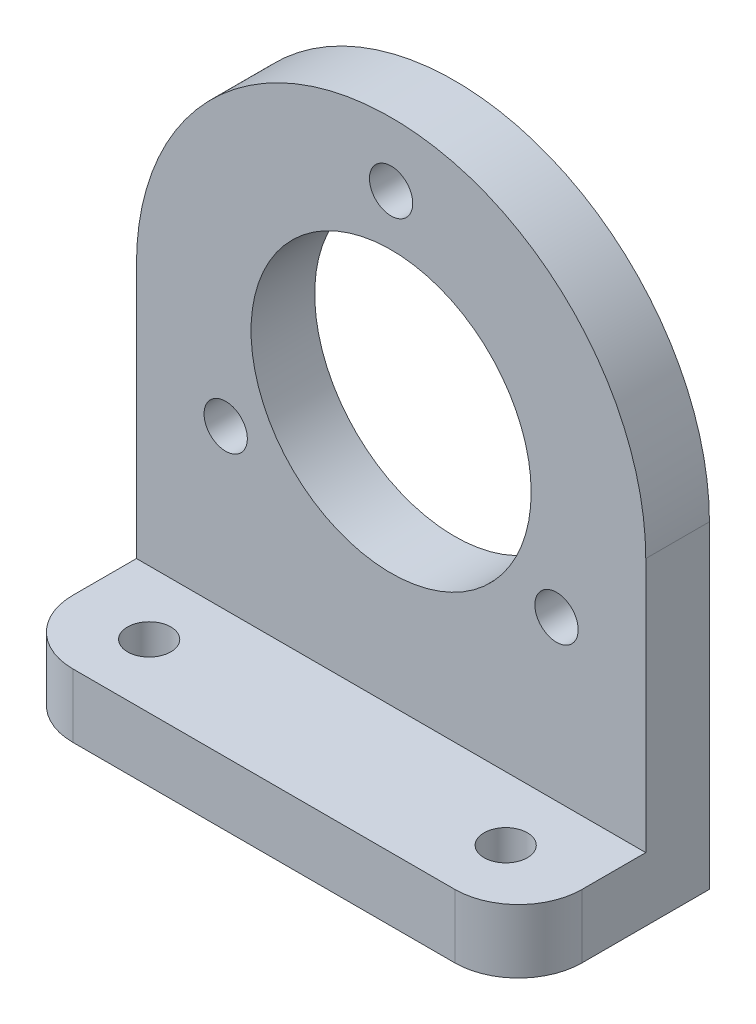
ISO-10303-21;
HEADER;
FILE_DESCRIPTION(('STEP AP214'),'2;1');
FILE_NAME('part.step','',(''),(''),'','','');
FILE_SCHEMA(('AUTOMOTIVE_DESIGN { 1 0 10303 214 1 1 1 1 }'));
ENDSEC;
DATA;
#1=APPLICATION_CONTEXT('core data for automotive mechanical design processes');
#2=APPLICATION_PROTOCOL_DEFINITION('international standard','automotive_design',2000,#1);
#3=PRODUCT_CONTEXT('',#1,'mechanical');
#4=PRODUCT('Part','Part','',(#3));
#5=PRODUCT_RELATED_PRODUCT_CATEGORY('part','',(#4));
#6=PRODUCT_DEFINITION_FORMATION('','',#4);
#7=PRODUCT_DEFINITION_CONTEXT('part definition',#1,'design');
#8=PRODUCT_DEFINITION('design','',#6,#7);
#9=PRODUCT_DEFINITION_SHAPE('','',#8);
#10=(LENGTH_UNIT() NAMED_UNIT(*) SI_UNIT(.MILLI.,.METRE.));
#11=(NAMED_UNIT(*) PLANE_ANGLE_UNIT() SI_UNIT($,.RADIAN.));
#12=(NAMED_UNIT(*) SI_UNIT($,.STERADIAN.) SOLID_ANGLE_UNIT());
#13=UNCERTAINTY_MEASURE_WITH_UNIT(LENGTH_MEASURE(1.E-05),#10,'distance_accuracy_value','');
#14=(GEOMETRIC_REPRESENTATION_CONTEXT(3) GLOBAL_UNCERTAINTY_ASSIGNED_CONTEXT((#13)) GLOBAL_UNIT_ASSIGNED_CONTEXT((#10,
#11,#12)) REPRESENTATION_CONTEXT('',''));
#15=CARTESIAN_POINT('',(0.,0.,0.));
#16=DIRECTION('',(0.,0.,1.));
#17=DIRECTION('',(1.,0.,0.));
#18=AXIS2_PLACEMENT_3D('',#15,#16,#17);
#19=CARTESIAN_POINT('',(-20.,-25.,15.));
#20=DIRECTION('',(0.,1.,0.));
#21=DIRECTION('',(0.,0.,1.));
#22=AXIS2_PLACEMENT_3D('',#19,#20,#21);
#23=PLANE('',#22);
#24=CARTESIAN_POINT('',(-14.,-25.,10.));
#25=DIRECTION('',(0.,1.,0.));
#26=DIRECTION('',(0.,0.,1.));
#27=AXIS2_PLACEMENT_3D('',#24,#25,#26);
#28=CIRCLE('',#27,1.69999999999999);
#29=CARTESIAN_POINT('',(-14.,-25.,11.7));
#30=VERTEX_POINT('',#29);
#31=EDGE_CURVE('E387',#30,#30,#28,.F.);
#32=ORIENTED_EDGE('',*,*,#31,.F.);
#33=EDGE_LOOP('',(#32));
#34=FACE_BOUND('',#33,.T.);
#35=DIRECTION('',(0.,0.,-1.));
#36=VECTOR('',#35,1.);
#37=CARTESIAN_POINT('',(20.,-25.,15.));
#38=LINE('',#37,#36);
#39=CARTESIAN_POINT('',(20.,-25.,10.));
#40=VERTEX_POINT('',#39);
#41=CARTESIAN_POINT('',(20.,-25.,0.));
#42=VERTEX_POINT('',#41);
#43=EDGE_CURVE('E110',#40,#42,#38,.T.);
#44=ORIENTED_EDGE('',*,*,#43,.F.);
#45=CARTESIAN_POINT('',(15.,-25.,10.));
#46=DIRECTION('',(0.,1.,0.));
#47=DIRECTION('',(0.,0.,1.));
#48=AXIS2_PLACEMENT_3D('',#45,#46,#47);
#49=CIRCLE('',#48,5.);
#50=CARTESIAN_POINT('',(15.,-25.,15.));
#51=VERTEX_POINT('',#50);
#52=EDGE_CURVE('E47',#40,#51,#49,.F.);
#53=ORIENTED_EDGE('',*,*,#52,.T.);
#54=DIRECTION('',(1.,0.,0.));
#55=VECTOR('',#54,1.);
#56=CARTESIAN_POINT('',(-20.,-25.,15.));
#57=LINE('',#56,#55);
#58=CARTESIAN_POINT('',(-15.,-25.,15.));
#59=VERTEX_POINT('',#58);
#60=EDGE_CURVE('E127',#59,#51,#57,.T.);
#61=ORIENTED_EDGE('',*,*,#60,.F.);
#62=CARTESIAN_POINT('',(-15.,-25.,10.));
#63=DIRECTION('',(0.,1.,0.));
#64=DIRECTION('',(0.,0.,1.));
#65=AXIS2_PLACEMENT_3D('',#62,#63,#64);
#66=CIRCLE('',#65,5.);
#67=CARTESIAN_POINT('',(-20.,-25.,10.));
#68=VERTEX_POINT('',#67);
#69=EDGE_CURVE('E54',#59,#68,#66,.F.);
#70=ORIENTED_EDGE('',*,*,#69,.T.);
#71=DIRECTION('',(0.,0.,-1.));
#72=VECTOR('',#71,1.);
#73=CARTESIAN_POINT('',(-20.,-25.,15.));
#74=LINE('',#73,#72);
#75=CARTESIAN_POINT('',(-20.,-25.,0.));
#76=VERTEX_POINT('',#75);
#77=EDGE_CURVE('E102',#68,#76,#74,.T.);
#78=ORIENTED_EDGE('',*,*,#77,.T.);
#79=DIRECTION('',(1.,0.,0.));
#80=VECTOR('',#79,1.);
#81=CARTESIAN_POINT('',(-20.,-25.,0.));
#82=LINE('',#81,#80);
#83=EDGE_CURVE('E106',#76,#42,#82,.T.);
#84=ORIENTED_EDGE('',*,*,#83,.T.);
#85=EDGE_LOOP('',(#44,#53,#61,#70,#78,#84));
#86=FACE_BOUND('',#85,.T.);
#87=CARTESIAN_POINT('',(14.,-25.,10.));
#88=DIRECTION('',(0.,1.,0.));
#89=DIRECTION('',(0.,0.,1.));
#90=AXIS2_PLACEMENT_3D('',#87,#88,#89);
#91=CIRCLE('',#90,1.69999999999999);
#92=CARTESIAN_POINT('',(14.,-25.,11.7));
#93=VERTEX_POINT('',#92);
#94=EDGE_CURVE('E128',#93,#93,#91,.F.);
#95=ORIENTED_EDGE('',*,*,#94,.F.);
#96=EDGE_LOOP('',(#95));
#97=FACE_BOUND('',#96,.T.);
#98=ADVANCED_FACE('F39',(#34,#86,#97),#23,.F.);
#99=CARTESIAN_POINT('',(0.,0.,0.));
#100=DIRECTION('',(0.,0.,1.));
#101=DIRECTION('',(1.,0.,0.));
#102=AXIS2_PLACEMENT_3D('',#99,#100,#101);
#103=PLANE('',#102);
#104=CARTESIAN_POINT('',(12.9903810567665,-7.50000000000006,0.));
#105=DIRECTION('',(0.,0.,1.));
#106=DIRECTION('',(1.,0.,0.));
#107=AXIS2_PLACEMENT_3D('',#104,#105,#106);
#108=CIRCLE('',#107,1.7);
#109=CARTESIAN_POINT('',(14.6903810567665,-7.50000000000006,0.));
#110=VERTEX_POINT('',#109);
#111=EDGE_CURVE('E149',#110,#110,#108,.F.);
#112=ORIENTED_EDGE('',*,*,#111,.F.);
#113=EDGE_LOOP('',(#112));
#114=FACE_BOUND('',#113,.T.);
#115=CARTESIAN_POINT('',(0.,15.,0.));
#116=DIRECTION('',(0.,0.,1.));
#117=DIRECTION('',(1.,0.,0.));
#118=AXIS2_PLACEMENT_3D('',#115,#116,#117);
#119=CIRCLE('',#118,1.7);
#120=CARTESIAN_POINT('',(1.7,15.,0.));
#121=VERTEX_POINT('',#120);
#122=EDGE_CURVE('E155',#121,#121,#119,.F.);
#123=ORIENTED_EDGE('',*,*,#122,.F.);
#124=EDGE_LOOP('',(#123));
#125=FACE_BOUND('',#124,.T.);
#126=CARTESIAN_POINT('',(0.,0.,0.));
#127=DIRECTION('',(0.,0.,1.));
#128=DIRECTION('',(1.,0.,0.));
#129=AXIS2_PLACEMENT_3D('',#126,#127,#128);
#130=CIRCLE('',#129,11.);
#131=CARTESIAN_POINT('',(11.,0.,0.));
#132=VERTEX_POINT('',#131);
#133=EDGE_CURVE('E158',#132,#132,#130,.T.);
#134=ORIENTED_EDGE('',*,*,#133,.T.);
#135=EDGE_LOOP('',(#134));
#136=FACE_BOUND('',#135,.T.);
#137=CARTESIAN_POINT('',(0.,0.,0.));
#138=DIRECTION('',(0.,0.,1.));
#139=DIRECTION('',(1.,0.,0.));
#140=AXIS2_PLACEMENT_3D('',#137,#138,#139);
#141=CIRCLE('',#140,20.);
#142=CARTESIAN_POINT('',(20.,0.,0.));
#143=VERTEX_POINT('',#142);
#144=CARTESIAN_POINT('',(-20.,0.,0.));
#145=VERTEX_POINT('',#144);
#146=EDGE_CURVE('E121',#143,#145,#141,.T.);
#147=ORIENTED_EDGE('',*,*,#146,.F.);
#148=DIRECTION('',(0.,-1.,0.));
#149=VECTOR('',#148,1.);
#150=CARTESIAN_POINT('',(20.,0.,0.));
#151=LINE('',#150,#149);
#152=EDGE_CURVE('E120',#143,#42,#151,.T.);
#153=ORIENTED_EDGE('',*,*,#152,.T.);
#154=ORIENTED_EDGE('',*,*,#83,.F.);
#155=DIRECTION('',(0.,-1.,0.));
#156=VECTOR('',#155,1.);
#157=CARTESIAN_POINT('',(-20.,0.,0.));
#158=LINE('',#157,#156);
#159=EDGE_CURVE('E113',#145,#76,#158,.T.);
#160=ORIENTED_EDGE('',*,*,#159,.F.);
#161=EDGE_LOOP('',(#147,#153,#154,#160));
#162=FACE_BOUND('',#161,.T.);
#163=CARTESIAN_POINT('',(-12.9903810567666,-7.49999999999988,0.));
#164=DIRECTION('',(0.,0.,1.));
#165=DIRECTION('',(1.,0.,0.));
#166=AXIS2_PLACEMENT_3D('',#163,#164,#165);
#167=CIRCLE('',#166,1.7);
#168=CARTESIAN_POINT('',(-11.2903810567666,-7.49999999999988,0.));
#169=VERTEX_POINT('',#168);
#170=EDGE_CURVE('E143',#169,#169,#167,.F.);
#171=ORIENTED_EDGE('',*,*,#170,.F.);
#172=EDGE_LOOP('',(#171));
#173=FACE_BOUND('',#172,.T.);
#174=ADVANCED_FACE('F124',(#114,#125,#136,#162,#173),#103,.F.);
#175=CARTESIAN_POINT('',(0.,0.,5.));
#176=DIRECTION('',(0.,0.,-1.));
#177=DIRECTION('',(-1.,0.,0.));
#178=AXIS2_PLACEMENT_3D('',#175,#176,#177);
#179=CYLINDRICAL_SURFACE('',#178,20.);
#180=ORIENTED_EDGE('',*,*,#146,.T.);
#181=DIRECTION('',(0.,0.,-1.));
#182=VECTOR('',#181,1.);
#183=CARTESIAN_POINT('',(-20.,0.,5.));
#184=LINE('',#183,#182);
#185=CARTESIAN_POINT('',(-20.,0.,5.));
#186=VERTEX_POINT('',#185);
#187=EDGE_CURVE('E116',#186,#145,#184,.T.);
#188=ORIENTED_EDGE('',*,*,#187,.F.);
#189=CARTESIAN_POINT('',(0.,0.,5.));
#190=DIRECTION('',(0.,0.,1.));
#191=DIRECTION('',(1.,0.,0.));
#192=AXIS2_PLACEMENT_3D('',#189,#190,#191);
#193=CIRCLE('',#192,20.);
#194=CARTESIAN_POINT('',(20.,0.,5.));
#195=VERTEX_POINT('',#194);
#196=EDGE_CURVE('E164',#195,#186,#193,.T.);
#197=ORIENTED_EDGE('',*,*,#196,.F.);
#198=DIRECTION('',(0.,0.,-1.));
#199=VECTOR('',#198,1.);
#200=CARTESIAN_POINT('',(20.,0.,5.));
#201=LINE('',#200,#199);
#202=EDGE_CURVE('E176',#195,#143,#201,.T.);
#203=ORIENTED_EDGE('',*,*,#202,.T.);
#204=EDGE_LOOP('',(#180,#188,#197,#203));
#205=FACE_BOUND('',#204,.T.);
#206=ADVANCED_FACE('F225',(#205),#179,.T.);
#207=CARTESIAN_POINT('',(-20.,0.,5.));
#208=DIRECTION('',(1.,0.,0.));
#209=DIRECTION('',(0.,1.,0.));
#210=AXIS2_PLACEMENT_3D('',#207,#208,#209);
#211=PLANE('',#210);
#212=ORIENTED_EDGE('',*,*,#77,.F.);
#213=DIRECTION('',(0.,-1.,0.));
#214=VECTOR('',#213,1.);
#215=CARTESIAN_POINT('',(-20.,-20.,10.));
#216=LINE('',#215,#214);
#217=CARTESIAN_POINT('',(-20.,-20.,10.));
#218=VERTEX_POINT('',#217);
#219=EDGE_CURVE('E11',#68,#218,#216,.F.);
#220=ORIENTED_EDGE('',*,*,#219,.T.);
#221=DIRECTION('',(0.,0.,-1.));
#222=VECTOR('',#221,1.);
#223=CARTESIAN_POINT('',(-20.,-20.,15.));
#224=LINE('',#223,#222);
#225=CARTESIAN_POINT('',(-20.,-20.,5.));
#226=VERTEX_POINT('',#225);
#227=EDGE_CURVE('E138',#218,#226,#224,.T.);
#228=ORIENTED_EDGE('',*,*,#227,.T.);
#229=DIRECTION('',(0.,-1.,0.));
#230=VECTOR('',#229,1.);
#231=CARTESIAN_POINT('',(-20.,0.,5.));
#232=LINE('',#231,#230);
#233=EDGE_CURVE('E167',#186,#226,#232,.T.);
#234=ORIENTED_EDGE('',*,*,#233,.F.);
#235=ORIENTED_EDGE('',*,*,#187,.T.);
#236=ORIENTED_EDGE('',*,*,#159,.T.);
#237=EDGE_LOOP('',(#212,#220,#228,#234,#235,#236));
#238=FACE_BOUND('',#237,.T.);
#239=ADVANCED_FACE('F114',(#238),#211,.F.);
#240=CARTESIAN_POINT('',(0.,0.,5.));
#241=DIRECTION('',(0.,0.,-1.));
#242=DIRECTION('',(-1.,0.,0.));
#243=AXIS2_PLACEMENT_3D('',#240,#241,#242);
#244=CYLINDRICAL_SURFACE('',#243,11.);
#245=CARTESIAN_POINT('',(0.,0.,5.));
#246=DIRECTION('',(0.,0.,1.));
#247=DIRECTION('',(1.,0.,0.));
#248=AXIS2_PLACEMENT_3D('',#245,#246,#247);
#249=CIRCLE('',#248,11.);
#250=CARTESIAN_POINT('',(11.,0.,5.));
#251=VERTEX_POINT('',#250);
#252=EDGE_CURVE('E161',#251,#251,#249,.T.);
#253=ORIENTED_EDGE('',*,*,#252,.T.);
#254=EDGE_LOOP('',(#253));
#255=FACE_BOUND('',#254,.T.);
#256=ORIENTED_EDGE('',*,*,#133,.F.);
#257=EDGE_LOOP('',(#256));
#258=FACE_BOUND('',#257,.T.);
#259=ADVANCED_FACE('F249',(#255,#258),#244,.F.);
#260=CARTESIAN_POINT('',(20.,0.,5.));
#261=DIRECTION('',(1.,0.,0.));
#262=DIRECTION('',(0.,1.,0.));
#263=AXIS2_PLACEMENT_3D('',#260,#261,#262);
#264=PLANE('',#263);
#265=DIRECTION('',(0.,0.,-1.));
#266=VECTOR('',#265,1.);
#267=CARTESIAN_POINT('',(20.,-20.,15.));
#268=LINE('',#267,#266);
#269=CARTESIAN_POINT('',(20.,-20.,10.));
#270=VERTEX_POINT('',#269);
#271=CARTESIAN_POINT('',(20.,-20.,5.));
#272=VERTEX_POINT('',#271);
#273=EDGE_CURVE('E140',#270,#272,#268,.T.);
#274=ORIENTED_EDGE('',*,*,#273,.F.);
#275=DIRECTION('',(0.,1.,0.));
#276=VECTOR('',#275,1.);
#277=CARTESIAN_POINT('',(20.,0.,10.));
#278=LINE('',#277,#276);
#279=EDGE_CURVE('E62',#270,#40,#278,.F.);
#280=ORIENTED_EDGE('',*,*,#279,.T.);
#281=ORIENTED_EDGE('',*,*,#43,.T.);
#282=ORIENTED_EDGE('',*,*,#152,.F.);
#283=ORIENTED_EDGE('',*,*,#202,.F.);
#284=DIRECTION('',(0.,-1.,0.));
#285=VECTOR('',#284,1.);
#286=CARTESIAN_POINT('',(20.,0.,5.));
#287=LINE('',#286,#285);
#288=EDGE_CURVE('E173',#195,#272,#287,.T.);
#289=ORIENTED_EDGE('',*,*,#288,.T.);
#290=EDGE_LOOP('',(#274,#280,#281,#282,#283,#289));
#291=FACE_BOUND('',#290,.T.);
#292=ADVANCED_FACE('F206',(#291),#264,.T.);
#293=CARTESIAN_POINT('',(0.,0.,5.));
#294=DIRECTION('',(0.,0.,1.));
#295=DIRECTION('',(1.,0.,0.));
#296=AXIS2_PLACEMENT_3D('',#293,#294,#295);
#297=PLANE('',#296);
#298=CARTESIAN_POINT('',(-12.9903810567666,-7.49999999999988,5.));
#299=DIRECTION('',(0.,0.,1.));
#300=DIRECTION('',(1.,0.,0.));
#301=AXIS2_PLACEMENT_3D('',#298,#299,#300);
#302=CIRCLE('',#301,1.7);
#303=CARTESIAN_POINT('',(-11.2903810567666,-7.49999999999988,5.));
#304=VERTEX_POINT('',#303);
#305=EDGE_CURVE('E109',#304,#304,#302,.T.);
#306=ORIENTED_EDGE('',*,*,#305,.F.);
#307=EDGE_LOOP('',(#306));
#308=FACE_BOUND('',#307,.T.);
#309=CARTESIAN_POINT('',(12.9903810567665,-7.50000000000006,5.));
#310=DIRECTION('',(0.,0.,1.));
#311=DIRECTION('',(1.,0.,0.));
#312=AXIS2_PLACEMENT_3D('',#309,#310,#311);
#313=CIRCLE('',#312,1.7);
#314=CARTESIAN_POINT('',(14.6903810567665,-7.50000000000006,5.));
#315=VERTEX_POINT('',#314);
#316=EDGE_CURVE('E146',#315,#315,#313,.T.);
#317=ORIENTED_EDGE('',*,*,#316,.F.);
#318=EDGE_LOOP('',(#317));
#319=FACE_BOUND('',#318,.T.);
#320=CARTESIAN_POINT('',(0.,15.,5.));
#321=DIRECTION('',(0.,0.,1.));
#322=DIRECTION('',(1.,0.,0.));
#323=AXIS2_PLACEMENT_3D('',#320,#321,#322);
#324=CIRCLE('',#323,1.7);
#325=CARTESIAN_POINT('',(1.7,15.,5.));
#326=VERTEX_POINT('',#325);
#327=EDGE_CURVE('E152',#326,#326,#324,.T.);
#328=ORIENTED_EDGE('',*,*,#327,.F.);
#329=EDGE_LOOP('',(#328));
#330=FACE_BOUND('',#329,.T.);
#331=ORIENTED_EDGE('',*,*,#252,.F.);
#332=EDGE_LOOP('',(#331));
#333=FACE_BOUND('',#332,.T.);
#334=ORIENTED_EDGE('',*,*,#196,.T.);
#335=ORIENTED_EDGE('',*,*,#233,.T.);
#336=DIRECTION('',(1.,0.,0.));
#337=VECTOR('',#336,1.);
#338=CARTESIAN_POINT('',(0.,-20.,5.));
#339=LINE('',#338,#337);
#340=EDGE_CURVE('E170',#226,#272,#339,.T.);
#341=ORIENTED_EDGE('',*,*,#340,.T.);
#342=ORIENTED_EDGE('',*,*,#288,.F.);
#343=EDGE_LOOP('',(#334,#335,#341,#342));
#344=FACE_BOUND('',#343,.T.);
#345=ADVANCED_FACE('F210',(#308,#319,#330,#333,#344),#297,.T.);
#346=CARTESIAN_POINT('',(0.,15.,5.));
#347=DIRECTION('',(0.,0.,1.));
#348=DIRECTION('',(1.,0.,0.));
#349=AXIS2_PLACEMENT_3D('',#346,#347,#348);
#350=CYLINDRICAL_SURFACE('',#349,1.7);
#351=ORIENTED_EDGE('',*,*,#122,.T.);
#352=EDGE_LOOP('',(#351));
#353=FACE_BOUND('',#352,.T.);
#354=ORIENTED_EDGE('',*,*,#327,.T.);
#355=EDGE_LOOP('',(#354));
#356=FACE_BOUND('',#355,.T.);
#357=ADVANCED_FACE('F239',(#353,#356),#350,.F.);
#358=CARTESIAN_POINT('',(12.9903810567665,-7.50000000000006,5.));
#359=DIRECTION('',(0.,0.,1.));
#360=DIRECTION('',(1.,0.,0.));
#361=AXIS2_PLACEMENT_3D('',#358,#359,#360);
#362=CYLINDRICAL_SURFACE('',#361,1.7);
#363=ORIENTED_EDGE('',*,*,#111,.T.);
#364=EDGE_LOOP('',(#363));
#365=FACE_BOUND('',#364,.T.);
#366=ORIENTED_EDGE('',*,*,#316,.T.);
#367=EDGE_LOOP('',(#366));
#368=FACE_BOUND('',#367,.T.);
#369=ADVANCED_FACE('F235',(#365,#368),#362,.F.);
#370=CARTESIAN_POINT('',(-12.9903810567666,-7.49999999999988,5.));
#371=DIRECTION('',(0.,0.,1.));
#372=DIRECTION('',(1.,0.,0.));
#373=AXIS2_PLACEMENT_3D('',#370,#371,#372);
#374=CYLINDRICAL_SURFACE('',#373,1.7);
#375=ORIENTED_EDGE('',*,*,#170,.T.);
#376=EDGE_LOOP('',(#375));
#377=FACE_BOUND('',#376,.T.);
#378=ORIENTED_EDGE('',*,*,#305,.T.);
#379=EDGE_LOOP('',(#378));
#380=FACE_BOUND('',#379,.T.);
#381=ADVANCED_FACE('F232',(#377,#380),#374,.F.);
#382=CARTESIAN_POINT('',(-20.,-20.,15.));
#383=DIRECTION('',(0.,-1.,0.));
#384=DIRECTION('',(0.,0.,-1.));
#385=AXIS2_PLACEMENT_3D('',#382,#383,#384);
#386=PLANE('',#385);
#387=CARTESIAN_POINT('',(-14.,-20.,10.));
#388=DIRECTION('',(0.,1.,0.));
#389=DIRECTION('',(0.,0.,1.));
#390=AXIS2_PLACEMENT_3D('',#387,#388,#389);
#391=CIRCLE('',#390,1.69999999999999);
#392=CARTESIAN_POINT('',(-14.,-20.,11.7));
#393=VERTEX_POINT('',#392);
#394=EDGE_CURVE('E390',#393,#393,#391,.T.);
#395=ORIENTED_EDGE('',*,*,#394,.F.);
#396=EDGE_LOOP('',(#395));
#397=FACE_BOUND('',#396,.T.);
#398=CARTESIAN_POINT('',(14.,-20.,10.));
#399=DIRECTION('',(0.,1.,0.));
#400=DIRECTION('',(0.,0.,1.));
#401=AXIS2_PLACEMENT_3D('',#398,#399,#400);
#402=CIRCLE('',#401,1.69999999999999);
#403=CARTESIAN_POINT('',(14.,-20.,11.7));
#404=VERTEX_POINT('',#403);
#405=EDGE_CURVE('E134',#404,#404,#402,.T.);
#406=ORIENTED_EDGE('',*,*,#405,.F.);
#407=EDGE_LOOP('',(#406));
#408=FACE_BOUND('',#407,.T.);
#409=DIRECTION('',(-1.,0.,0.));
#410=VECTOR('',#409,1.);
#411=CARTESIAN_POINT('',(-20.,-20.,15.));
#412=LINE('',#411,#410);
#413=CARTESIAN_POINT('',(15.,-20.,15.));
#414=VERTEX_POINT('',#413);
#415=CARTESIAN_POINT('',(-15.,-20.,15.));
#416=VERTEX_POINT('',#415);
#417=EDGE_CURVE('E131',#414,#416,#412,.T.);
#418=ORIENTED_EDGE('',*,*,#417,.F.);
#419=CARTESIAN_POINT('',(15.,-20.,10.));
#420=DIRECTION('',(0.,-1.,0.));
#421=DIRECTION('',(0.,0.,-1.));
#422=AXIS2_PLACEMENT_3D('',#419,#420,#421);
#423=CIRCLE('',#422,5.);
#424=EDGE_CURVE('E191',#414,#270,#423,.F.);
#425=ORIENTED_EDGE('',*,*,#424,.T.);
#426=ORIENTED_EDGE('',*,*,#273,.T.);
#427=ORIENTED_EDGE('',*,*,#340,.F.);
#428=ORIENTED_EDGE('',*,*,#227,.F.);
#429=CARTESIAN_POINT('',(-15.,-20.,10.));
#430=DIRECTION('',(0.,-1.,0.));
#431=DIRECTION('',(0.,0.,-1.));
#432=AXIS2_PLACEMENT_3D('',#429,#430,#431);
#433=CIRCLE('',#432,5.);
#434=EDGE_CURVE('E189',#218,#416,#433,.F.);
#435=ORIENTED_EDGE('',*,*,#434,.T.);
#436=EDGE_LOOP('',(#418,#425,#426,#427,#428,#435));
#437=FACE_BOUND('',#436,.T.);
#438=ADVANCED_FACE('F204',(#397,#408,#437),#386,.F.);
#439=CARTESIAN_POINT('',(0.,0.,15.));
#440=DIRECTION('',(0.,0.,1.));
#441=DIRECTION('',(1.,0.,0.));
#442=AXIS2_PLACEMENT_3D('',#439,#440,#441);
#443=PLANE('',#442);
#444=ORIENTED_EDGE('',*,*,#60,.T.);
#445=DIRECTION('',(0.,1.,0.));
#446=VECTOR('',#445,1.);
#447=CARTESIAN_POINT('',(15.,0.,15.));
#448=LINE('',#447,#446);
#449=EDGE_CURVE('E186',#51,#414,#448,.T.);
#450=ORIENTED_EDGE('',*,*,#449,.T.);
#451=ORIENTED_EDGE('',*,*,#417,.T.);
#452=DIRECTION('',(0.,-1.,0.));
#453=VECTOR('',#452,1.);
#454=CARTESIAN_POINT('',(-15.,-25.,15.));
#455=LINE('',#454,#453);
#456=EDGE_CURVE('E183',#416,#59,#455,.T.);
#457=ORIENTED_EDGE('',*,*,#456,.T.);
#458=EDGE_LOOP('',(#444,#450,#451,#457));
#459=FACE_BOUND('',#458,.T.);
#460=ADVANCED_FACE('F198',(#459),#443,.T.);
#461=CARTESIAN_POINT('',(14.,-20.,10.));
#462=DIRECTION('',(0.,1.,0.));
#463=DIRECTION('',(0.,0.,1.));
#464=AXIS2_PLACEMENT_3D('',#461,#462,#463);
#465=CYLINDRICAL_SURFACE('',#464,1.69999999999999);
#466=ORIENTED_EDGE('',*,*,#94,.T.);
#467=EDGE_LOOP('',(#466));
#468=FACE_BOUND('',#467,.T.);
#469=ORIENTED_EDGE('',*,*,#405,.T.);
#470=EDGE_LOOP('',(#469));
#471=FACE_BOUND('',#470,.T.);
#472=ADVANCED_FACE('F301',(#468,#471),#465,.F.);
#473=CARTESIAN_POINT('',(-14.,-20.,10.));
#474=DIRECTION('',(0.,1.,0.));
#475=DIRECTION('',(0.,0.,1.));
#476=AXIS2_PLACEMENT_3D('',#473,#474,#475);
#477=CYLINDRICAL_SURFACE('',#476,1.69999999999999);
#478=ORIENTED_EDGE('',*,*,#31,.T.);
#479=EDGE_LOOP('',(#478));
#480=FACE_BOUND('',#479,.T.);
#481=ORIENTED_EDGE('',*,*,#394,.T.);
#482=EDGE_LOOP('',(#481));
#483=FACE_BOUND('',#482,.T.);
#484=ADVANCED_FACE('F218',(#480,#483),#477,.F.);
#485=CARTESIAN_POINT('',(15.,0.,10.));
#486=DIRECTION('',(0.,1.,0.));
#487=DIRECTION('',(-1.,0.,0.));
#488=AXIS2_PLACEMENT_3D('',#485,#486,#487);
#489=CYLINDRICAL_SURFACE('',#488,5.);
#490=ORIENTED_EDGE('',*,*,#52,.F.);
#491=ORIENTED_EDGE('',*,*,#279,.F.);
#492=ORIENTED_EDGE('',*,*,#424,.F.);
#493=ORIENTED_EDGE('',*,*,#449,.F.);
#494=EDGE_LOOP('',(#490,#491,#492,#493));
#495=FACE_BOUND('',#494,.T.);
#496=ADVANCED_FACE('F202',(#495),#489,.T.);
#497=CARTESIAN_POINT('',(-15.,0.,10.));
#498=DIRECTION('',(0.,1.,0.));
#499=DIRECTION('',(-1.,0.,0.));
#500=AXIS2_PLACEMENT_3D('',#497,#498,#499);
#501=CYLINDRICAL_SURFACE('',#500,5.);
#502=ORIENTED_EDGE('',*,*,#434,.F.);
#503=ORIENTED_EDGE('',*,*,#219,.F.);
#504=ORIENTED_EDGE('',*,*,#69,.F.);
#505=ORIENTED_EDGE('',*,*,#456,.F.);
#506=EDGE_LOOP('',(#502,#503,#504,#505));
#507=FACE_BOUND('',#506,.T.);
#508=ADVANCED_FACE('F41',(#507),#501,.T.);
#509=CLOSED_SHELL('',(#98,#174,#206,#239,#259,#292,#345,#357,#369,#381,#438,#460,#472,#484,#496,#508));
#510=MANIFOLD_SOLID_BREP('B2',#509);
#511=ADVANCED_BREP_SHAPE_REPRESENTATION('',(#18,#510),#14);
#512=SHAPE_DEFINITION_REPRESENTATION(#9,#511);
ENDSEC;
END-ISO-10303-21;
